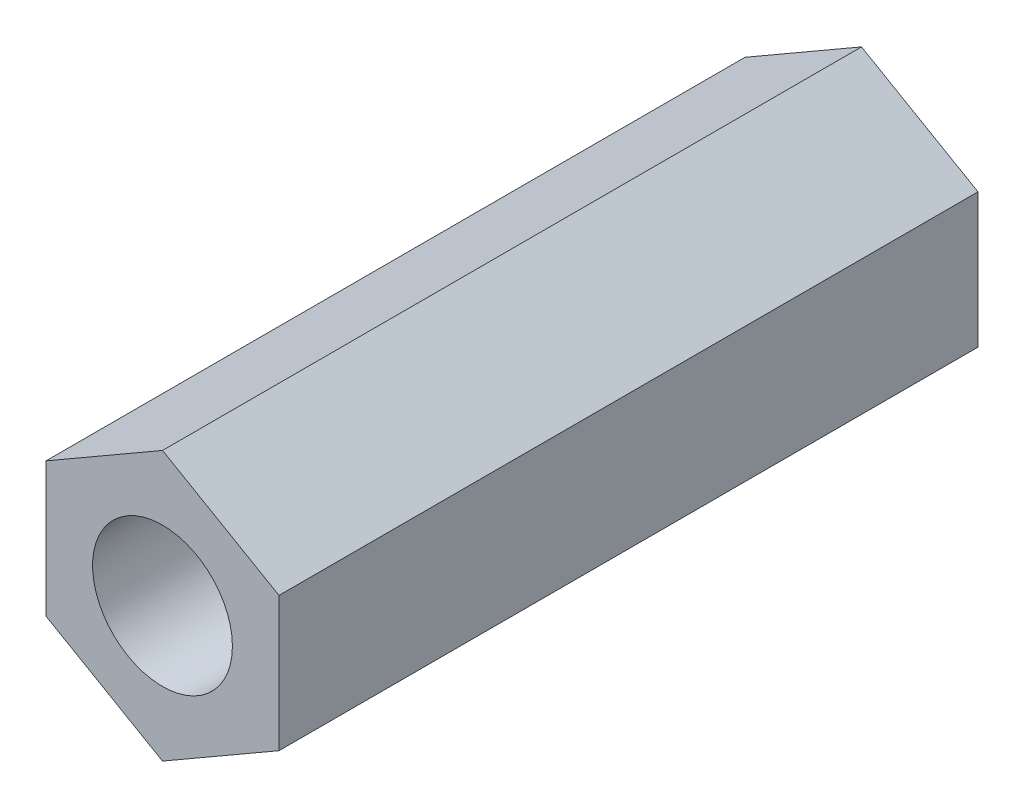
ISO-10303-21;
HEADER;
FILE_DESCRIPTION(('STEP AP214'),'2;1');
FILE_NAME('part.step','',(''),(''),'','','');
FILE_SCHEMA(('AUTOMOTIVE_DESIGN { 1 0 10303 214 1 1 1 1 }'));
ENDSEC;
DATA;
#1=APPLICATION_CONTEXT('core data for automotive mechanical design processes');
#2=APPLICATION_PROTOCOL_DEFINITION('international standard','automotive_design',2000,#1);
#3=PRODUCT_CONTEXT('',#1,'mechanical');
#4=PRODUCT('Part','Part','',(#3));
#5=PRODUCT_RELATED_PRODUCT_CATEGORY('part','',(#4));
#6=PRODUCT_DEFINITION_FORMATION('','',#4);
#7=PRODUCT_DEFINITION_CONTEXT('part definition',#1,'design');
#8=PRODUCT_DEFINITION('design','',#6,#7);
#9=PRODUCT_DEFINITION_SHAPE('','',#8);
#10=(LENGTH_UNIT() NAMED_UNIT(*) SI_UNIT(.MILLI.,.METRE.));
#11=(NAMED_UNIT(*) PLANE_ANGLE_UNIT() SI_UNIT($,.RADIAN.));
#12=(NAMED_UNIT(*) SI_UNIT($,.STERADIAN.) SOLID_ANGLE_UNIT());
#13=UNCERTAINTY_MEASURE_WITH_UNIT(LENGTH_MEASURE(1.E-05),#10,'distance_accuracy_value','');
#14=(GEOMETRIC_REPRESENTATION_CONTEXT(3) GLOBAL_UNCERTAINTY_ASSIGNED_CONTEXT((#13)) GLOBAL_UNIT_ASSIGNED_CONTEXT((#10,
#11,#12)) REPRESENTATION_CONTEXT('',''));
#15=CARTESIAN_POINT('',(0.,0.,0.));
#16=DIRECTION('',(0.,0.,1.));
#17=DIRECTION('',(1.,0.,0.));
#18=AXIS2_PLACEMENT_3D('',#15,#16,#17);
#19=CARTESIAN_POINT('',(0.,0.,15.));
#20=DIRECTION('',(0.,0.,1.));
#21=DIRECTION('',(1.,0.,0.));
#22=AXIS2_PLACEMENT_3D('',#19,#20,#21);
#23=PLANE('',#22);
#24=DIRECTION('',(0.,1.,0.));
#25=VECTOR('',#24,1.);
#26=CARTESIAN_POINT('',(2.5,-1.44337567297406,15.));
#27=LINE('',#26,#25);
#28=CARTESIAN_POINT('',(2.5,-1.44337567297406,15.));
#29=VERTEX_POINT('',#28);
#30=CARTESIAN_POINT('',(2.5,1.44337567297406,15.));
#31=VERTEX_POINT('',#30);
#32=EDGE_CURVE('E128',#29,#31,#27,.T.);
#33=ORIENTED_EDGE('',*,*,#32,.T.);
#34=DIRECTION('',(-0.866025403784439,0.5,0.));
#35=VECTOR('',#34,1.);
#36=CARTESIAN_POINT('',(2.5,1.44337567297406,15.));
#37=LINE('',#36,#35);
#38=CARTESIAN_POINT('',(0.,2.88675134594813,15.));
#39=VERTEX_POINT('',#38);
#40=EDGE_CURVE('E86',#31,#39,#37,.T.);
#41=ORIENTED_EDGE('',*,*,#40,.T.);
#42=DIRECTION('',(-0.866025403784439,-0.5,0.));
#43=VECTOR('',#42,1.);
#44=CARTESIAN_POINT('',(0.,2.88675134594813,15.));
#45=LINE('',#44,#43);
#46=CARTESIAN_POINT('',(-2.5,1.44337567297407,15.));
#47=VERTEX_POINT('',#46);
#48=EDGE_CURVE('E99',#39,#47,#45,.T.);
#49=ORIENTED_EDGE('',*,*,#48,.T.);
#50=DIRECTION('',(0.,-1.,0.));
#51=VECTOR('',#50,1.);
#52=CARTESIAN_POINT('',(-2.5,1.44337567297407,15.));
#53=LINE('',#52,#51);
#54=CARTESIAN_POINT('',(-2.5,-1.44337567297406,15.));
#55=VERTEX_POINT('',#54);
#56=EDGE_CURVE('E93',#47,#55,#53,.T.);
#57=ORIENTED_EDGE('',*,*,#56,.T.);
#58=DIRECTION('',(0.866025403784439,-0.5,0.));
#59=VECTOR('',#58,1.);
#60=CARTESIAN_POINT('',(-2.5,-1.44337567297406,15.));
#61=LINE('',#60,#59);
#62=CARTESIAN_POINT('',(0.,-2.88675134594813,15.));
#63=VERTEX_POINT('',#62);
#64=EDGE_CURVE('E97',#55,#63,#61,.T.);
#65=ORIENTED_EDGE('',*,*,#64,.T.);
#66=DIRECTION('',(0.866025403784439,0.5,0.));
#67=VECTOR('',#66,1.);
#68=CARTESIAN_POINT('',(0.,-2.88675134594813,15.));
#69=LINE('',#68,#67);
#70=EDGE_CURVE('E49',#63,#29,#69,.T.);
#71=ORIENTED_EDGE('',*,*,#70,.T.);
#72=EDGE_LOOP('',(#33,#41,#49,#57,#65,#71));
#73=FACE_BOUND('',#72,.T.);
#74=CARTESIAN_POINT('',(0.,0.,15.));
#75=DIRECTION('',(0.,0.,1.));
#76=DIRECTION('',(1.,0.,0.));
#77=AXIS2_PLACEMENT_3D('',#74,#75,#76);
#78=CIRCLE('',#77,1.5);
#79=CARTESIAN_POINT('',(1.5,0.,15.));
#80=VERTEX_POINT('',#79);
#81=EDGE_CURVE('E121',#80,#80,#78,.T.);
#82=ORIENTED_EDGE('',*,*,#81,.F.);
#83=EDGE_LOOP('',(#82));
#84=FACE_BOUND('',#83,.T.);
#85=ADVANCED_FACE('F32',(#73,#84),#23,.T.);
#86=CARTESIAN_POINT('',(0.,0.,0.));
#87=DIRECTION('',(0.,0.,1.));
#88=DIRECTION('',(1.,0.,0.));
#89=AXIS2_PLACEMENT_3D('',#86,#87,#88);
#90=PLANE('',#89);
#91=DIRECTION('',(0.,1.,0.));
#92=VECTOR('',#91,1.);
#93=CARTESIAN_POINT('',(2.5,-1.44337567297406,0.));
#94=LINE('',#93,#92);
#95=CARTESIAN_POINT('',(2.5,-1.44337567297406,0.));
#96=VERTEX_POINT('',#95);
#97=CARTESIAN_POINT('',(2.5,1.44337567297406,0.));
#98=VERTEX_POINT('',#97);
#99=EDGE_CURVE('E117',#96,#98,#94,.T.);
#100=ORIENTED_EDGE('',*,*,#99,.F.);
#101=DIRECTION('',(0.866025403784439,0.5,0.));
#102=VECTOR('',#101,1.);
#103=CARTESIAN_POINT('',(0.,-2.88675134594813,0.));
#104=LINE('',#103,#102);
#105=CARTESIAN_POINT('',(0.,-2.88675134594813,0.));
#106=VERTEX_POINT('',#105);
#107=EDGE_CURVE('E78',#106,#96,#104,.T.);
#108=ORIENTED_EDGE('',*,*,#107,.F.);
#109=DIRECTION('',(0.866025403784439,-0.5,0.));
#110=VECTOR('',#109,1.);
#111=CARTESIAN_POINT('',(-2.5,-1.44337567297406,0.));
#112=LINE('',#111,#110);
#113=CARTESIAN_POINT('',(-2.5,-1.44337567297406,0.));
#114=VERTEX_POINT('',#113);
#115=EDGE_CURVE('E72',#114,#106,#112,.T.);
#116=ORIENTED_EDGE('',*,*,#115,.F.);
#117=DIRECTION('',(0.,-1.,0.));
#118=VECTOR('',#117,1.);
#119=CARTESIAN_POINT('',(-2.5,1.44337567297407,0.));
#120=LINE('',#119,#118);
#121=CARTESIAN_POINT('',(-2.5,1.44337567297407,0.));
#122=VERTEX_POINT('',#121);
#123=EDGE_CURVE('E107',#122,#114,#120,.T.);
#124=ORIENTED_EDGE('',*,*,#123,.F.);
#125=DIRECTION('',(-0.866025403784439,-0.5,0.));
#126=VECTOR('',#125,1.);
#127=CARTESIAN_POINT('',(0.,2.88675134594813,0.));
#128=LINE('',#127,#126);
#129=CARTESIAN_POINT('',(0.,2.88675134594813,0.));
#130=VERTEX_POINT('',#129);
#131=EDGE_CURVE('E123',#130,#122,#128,.T.);
#132=ORIENTED_EDGE('',*,*,#131,.F.);
#133=DIRECTION('',(-0.866025403784439,0.5,0.));
#134=VECTOR('',#133,1.);
#135=CARTESIAN_POINT('',(2.5,1.44337567297406,0.));
#136=LINE('',#135,#134);
#137=EDGE_CURVE('E120',#98,#130,#136,.T.);
#138=ORIENTED_EDGE('',*,*,#137,.F.);
#139=EDGE_LOOP('',(#100,#108,#116,#124,#132,#138));
#140=FACE_BOUND('',#139,.T.);
#141=CARTESIAN_POINT('',(0.,0.,0.));
#142=DIRECTION('',(0.,0.,1.));
#143=DIRECTION('',(1.,0.,0.));
#144=AXIS2_PLACEMENT_3D('',#141,#142,#143);
#145=CIRCLE('',#144,1.5);
#146=CARTESIAN_POINT('',(1.5,0.,0.));
#147=VERTEX_POINT('',#146);
#148=EDGE_CURVE('E221',#147,#147,#145,.T.);
#149=ORIENTED_EDGE('',*,*,#148,.T.);
#150=EDGE_LOOP('',(#149));
#151=FACE_BOUND('',#150,.T.);
#152=ADVANCED_FACE('F137',(#140,#151),#90,.F.);
#153=CARTESIAN_POINT('',(2.5,-1.44337567297406,15.));
#154=DIRECTION('',(-1.,0.,0.));
#155=DIRECTION('',(0.,-1.,0.));
#156=AXIS2_PLACEMENT_3D('',#153,#154,#155);
#157=PLANE('',#156);
#158=ORIENTED_EDGE('',*,*,#99,.T.);
#159=DIRECTION('',(0.,0.,-1.));
#160=VECTOR('',#159,1.);
#161=CARTESIAN_POINT('',(2.5,1.44337567297406,15.));
#162=LINE('',#161,#160);
#163=EDGE_CURVE('E11',#31,#98,#162,.T.);
#164=ORIENTED_EDGE('',*,*,#163,.F.);
#165=ORIENTED_EDGE('',*,*,#32,.F.);
#166=DIRECTION('',(0.,0.,-1.));
#167=VECTOR('',#166,1.);
#168=CARTESIAN_POINT('',(2.5,-1.44337567297406,15.));
#169=LINE('',#168,#167);
#170=EDGE_CURVE('E113',#29,#96,#169,.T.);
#171=ORIENTED_EDGE('',*,*,#170,.T.);
#172=EDGE_LOOP('',(#158,#164,#165,#171));
#173=FACE_BOUND('',#172,.T.);
#174=ADVANCED_FACE('F34',(#173),#157,.F.);
#175=CARTESIAN_POINT('',(2.5,1.44337567297406,15.));
#176=DIRECTION('',(-0.5,-0.866025403784439,0.));
#177=DIRECTION('',(0.866025403784439,-0.5,0.));
#178=AXIS2_PLACEMENT_3D('',#175,#176,#177);
#179=PLANE('',#178);
#180=ORIENTED_EDGE('',*,*,#137,.T.);
#181=DIRECTION('',(0.,0.,-1.));
#182=VECTOR('',#181,1.);
#183=CARTESIAN_POINT('',(0.,2.88675134594813,15.));
#184=LINE('',#183,#182);
#185=EDGE_CURVE('E41',#39,#130,#184,.T.);
#186=ORIENTED_EDGE('',*,*,#185,.F.);
#187=ORIENTED_EDGE('',*,*,#40,.F.);
#188=ORIENTED_EDGE('',*,*,#163,.T.);
#189=EDGE_LOOP('',(#180,#186,#187,#188));
#190=FACE_BOUND('',#189,.T.);
#191=ADVANCED_FACE('F162',(#190),#179,.F.);
#192=CARTESIAN_POINT('',(0.,2.88675134594813,15.));
#193=DIRECTION('',(0.5,-0.866025403784439,0.));
#194=DIRECTION('',(0.866025403784439,0.5,0.));
#195=AXIS2_PLACEMENT_3D('',#192,#193,#194);
#196=PLANE('',#195);
#197=ORIENTED_EDGE('',*,*,#131,.T.);
#198=DIRECTION('',(0.,0.,-1.));
#199=VECTOR('',#198,1.);
#200=CARTESIAN_POINT('',(-2.5,1.44337567297407,15.));
#201=LINE('',#200,#199);
#202=EDGE_CURVE('E108',#47,#122,#201,.T.);
#203=ORIENTED_EDGE('',*,*,#202,.F.);
#204=ORIENTED_EDGE('',*,*,#48,.F.);
#205=ORIENTED_EDGE('',*,*,#185,.T.);
#206=EDGE_LOOP('',(#197,#203,#204,#205));
#207=FACE_BOUND('',#206,.T.);
#208=ADVANCED_FACE('F134',(#207),#196,.F.);
#209=CARTESIAN_POINT('',(-2.5,1.44337567297407,15.));
#210=DIRECTION('',(1.,0.,0.));
#211=DIRECTION('',(0.,1.,0.));
#212=AXIS2_PLACEMENT_3D('',#209,#210,#211);
#213=PLANE('',#212);
#214=ORIENTED_EDGE('',*,*,#123,.T.);
#215=DIRECTION('',(0.,0.,-1.));
#216=VECTOR('',#215,1.);
#217=CARTESIAN_POINT('',(-2.5,-1.44337567297406,15.));
#218=LINE('',#217,#216);
#219=EDGE_CURVE('E104',#55,#114,#218,.T.);
#220=ORIENTED_EDGE('',*,*,#219,.F.);
#221=ORIENTED_EDGE('',*,*,#56,.F.);
#222=ORIENTED_EDGE('',*,*,#202,.T.);
#223=EDGE_LOOP('',(#214,#220,#221,#222));
#224=FACE_BOUND('',#223,.T.);
#225=ADVANCED_FACE('F105',(#224),#213,.F.);
#226=CARTESIAN_POINT('',(-2.5,-1.44337567297406,15.));
#227=DIRECTION('',(0.5,0.866025403784439,0.));
#228=DIRECTION('',(-0.866025403784439,0.5,0.));
#229=AXIS2_PLACEMENT_3D('',#226,#227,#228);
#230=PLANE('',#229);
#231=ORIENTED_EDGE('',*,*,#115,.T.);
#232=DIRECTION('',(0.,0.,-1.));
#233=VECTOR('',#232,1.);
#234=CARTESIAN_POINT('',(0.,-2.88675134594813,15.));
#235=LINE('',#234,#233);
#236=EDGE_CURVE('E109',#63,#106,#235,.T.);
#237=ORIENTED_EDGE('',*,*,#236,.F.);
#238=ORIENTED_EDGE('',*,*,#64,.F.);
#239=ORIENTED_EDGE('',*,*,#219,.T.);
#240=EDGE_LOOP('',(#231,#237,#238,#239));
#241=FACE_BOUND('',#240,.T.);
#242=ADVANCED_FACE('F111',(#241),#230,.F.);
#243=CARTESIAN_POINT('',(0.,-2.88675134594813,15.));
#244=DIRECTION('',(-0.5,0.866025403784439,0.));
#245=DIRECTION('',(-0.866025403784439,-0.5,0.));
#246=AXIS2_PLACEMENT_3D('',#243,#244,#245);
#247=PLANE('',#246);
#248=ORIENTED_EDGE('',*,*,#107,.T.);
#249=ORIENTED_EDGE('',*,*,#170,.F.);
#250=ORIENTED_EDGE('',*,*,#70,.F.);
#251=ORIENTED_EDGE('',*,*,#236,.T.);
#252=EDGE_LOOP('',(#248,#249,#250,#251));
#253=FACE_BOUND('',#252,.T.);
#254=ADVANCED_FACE('F142',(#253),#247,.F.);
#255=CARTESIAN_POINT('',(0.,0.,15.));
#256=DIRECTION('',(0.,0.,-1.));
#257=DIRECTION('',(-1.,0.,0.));
#258=AXIS2_PLACEMENT_3D('',#255,#256,#257);
#259=CYLINDRICAL_SURFACE('',#258,1.5);
#260=ORIENTED_EDGE('',*,*,#81,.T.);
#261=EDGE_LOOP('',(#260));
#262=FACE_BOUND('',#261,.T.);
#263=ORIENTED_EDGE('',*,*,#148,.F.);
#264=EDGE_LOOP('',(#263));
#265=FACE_BOUND('',#264,.T.);
#266=ADVANCED_FACE('F144',(#262,#265),#259,.F.);
#267=CLOSED_SHELL('',(#85,#152,#174,#191,#208,#225,#242,#254,#266));
#268=MANIFOLD_SOLID_BREP('B2',#267);
#269=ADVANCED_BREP_SHAPE_REPRESENTATION('',(#18,#268),#14);
#270=SHAPE_DEFINITION_REPRESENTATION(#9,#269);
ENDSEC;
END-ISO-10303-21;
